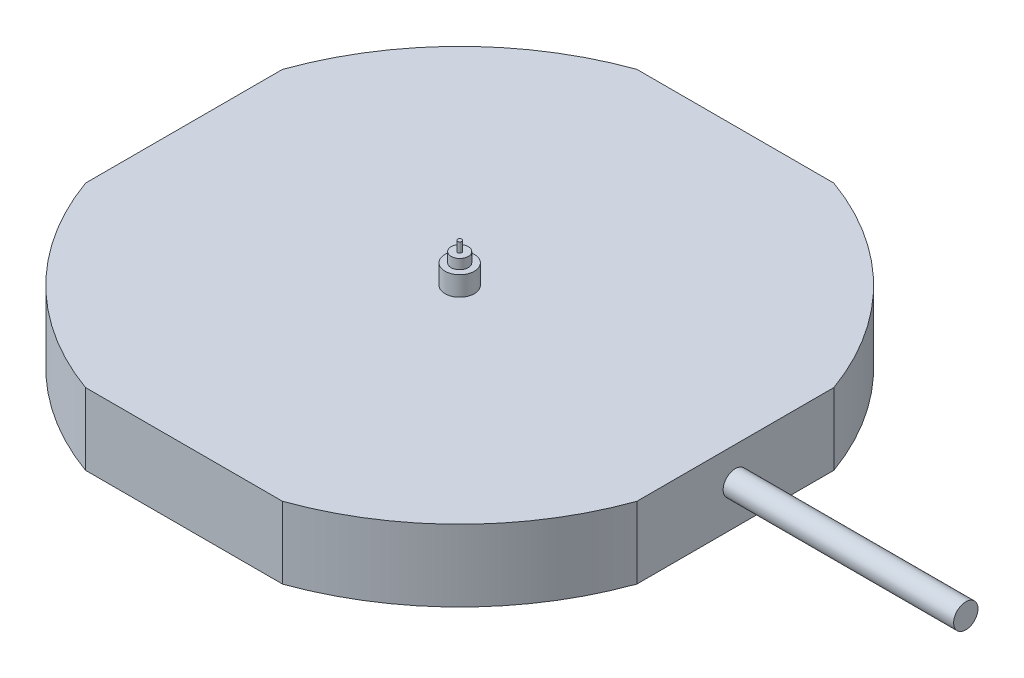
ISO-10303-21;
HEADER;
FILE_DESCRIPTION(('STEP AP214'),'2;1');
FILE_NAME('part.step','',(''),(''),'','','');
FILE_SCHEMA(('AUTOMOTIVE_DESIGN { 1 0 10303 214 1 1 1 1 }'));
ENDSEC;
DATA;
#1=APPLICATION_CONTEXT('core data for automotive mechanical design processes');
#2=APPLICATION_PROTOCOL_DEFINITION('international standard','automotive_design',2000,#1);
#3=PRODUCT_CONTEXT('',#1,'mechanical');
#4=PRODUCT('Part','Part','',(#3));
#5=PRODUCT_RELATED_PRODUCT_CATEGORY('part','',(#4));
#6=PRODUCT_DEFINITION_FORMATION('','',#4);
#7=PRODUCT_DEFINITION_CONTEXT('part definition',#1,'design');
#8=PRODUCT_DEFINITION('design','',#6,#7);
#9=PRODUCT_DEFINITION_SHAPE('','',#8);
#10=(LENGTH_UNIT() NAMED_UNIT(*) SI_UNIT(.MILLI.,.METRE.));
#11=(NAMED_UNIT(*) PLANE_ANGLE_UNIT() SI_UNIT($,.RADIAN.));
#12=(NAMED_UNIT(*) SI_UNIT($,.STERADIAN.) SOLID_ANGLE_UNIT());
#13=UNCERTAINTY_MEASURE_WITH_UNIT(LENGTH_MEASURE(1.E-05),#10,'distance_accuracy_value','');
#14=(GEOMETRIC_REPRESENTATION_CONTEXT(3) GLOBAL_UNCERTAINTY_ASSIGNED_CONTEXT((#13)) GLOBAL_UNIT_ASSIGNED_CONTEXT((#10,
#11,#12)) REPRESENTATION_CONTEXT('',''));
#15=CARTESIAN_POINT('',(0.,0.,0.));
#16=DIRECTION('',(0.,0.,1.));
#17=DIRECTION('',(1.,0.,0.));
#18=AXIS2_PLACEMENT_3D('',#15,#16,#17);
#19=CARTESIAN_POINT('',(0.,2.94,0.));
#20=DIRECTION('',(0.,-1.,0.));
#21=DIRECTION('',(0.,0.,-1.));
#22=AXIS2_PLACEMENT_3D('',#19,#20,#21);
#23=CYLINDRICAL_SURFACE('',#22,12.);
#24=DIRECTION('',(0.,-1.,0.));
#25=VECTOR('',#24,1.);
#26=CARTESIAN_POINT('',(4.03856410126174,2.94,-11.3));
#27=LINE('',#26,#25);
#28=CARTESIAN_POINT('',(4.03856410126174,2.94,-11.3));
#29=VERTEX_POINT('',#28);
#30=CARTESIAN_POINT('',(4.03856410126174,0.,-11.3));
#31=VERTEX_POINT('',#30);
#32=EDGE_CURVE('E57',#29,#31,#27,.T.);
#33=ORIENTED_EDGE('',*,*,#32,.F.);
#34=CARTESIAN_POINT('',(0.,2.94,0.));
#35=DIRECTION('',(0.,1.,0.));
#36=DIRECTION('',(0.,0.,1.));
#37=AXIS2_PLACEMENT_3D('',#34,#35,#36);
#38=CIRCLE('',#37,12.);
#39=CARTESIAN_POINT('',(11.3,2.94,-4.03856410126174));
#40=VERTEX_POINT('',#39);
#41=EDGE_CURVE('E141',#40,#29,#38,.T.);
#42=ORIENTED_EDGE('',*,*,#41,.F.);
#43=DIRECTION('',(0.,-1.,0.));
#44=VECTOR('',#43,1.);
#45=CARTESIAN_POINT('',(11.3,2.94,-4.03856410126174));
#46=LINE('',#45,#44);
#47=CARTESIAN_POINT('',(11.3,0.,-4.03856410126174));
#48=VERTEX_POINT('',#47);
#49=EDGE_CURVE('E187',#48,#40,#46,.F.);
#50=ORIENTED_EDGE('',*,*,#49,.F.);
#51=CARTESIAN_POINT('',(0.,0.,0.));
#52=DIRECTION('',(0.,1.,0.));
#53=DIRECTION('',(0.,0.,1.));
#54=AXIS2_PLACEMENT_3D('',#51,#52,#53);
#55=CIRCLE('',#54,12.);
#56=EDGE_CURVE('E118',#48,#31,#55,.T.);
#57=ORIENTED_EDGE('',*,*,#56,.T.);
#58=EDGE_LOOP('',(#33,#42,#50,#57));
#59=FACE_BOUND('',#58,.T.);
#60=ADVANCED_FACE('F33',(#59),#23,.T.);
#61=DIRECTION('',(0.,-1.,0.));
#62=VECTOR('',#61,1.);
#63=CARTESIAN_POINT('',(-4.03856410126174,2.94,-11.3));
#64=LINE('',#63,#62);
#65=CARTESIAN_POINT('',(-4.03856410126174,0.,-11.3));
#66=VERTEX_POINT('',#65);
#67=CARTESIAN_POINT('',(-4.03856410126174,2.94,-11.3));
#68=VERTEX_POINT('',#67);
#69=EDGE_CURVE('E99',#66,#68,#64,.F.);
#70=ORIENTED_EDGE('',*,*,#69,.F.);
#71=CARTESIAN_POINT('',(-11.3,0.,-4.03856410126174));
#72=VERTEX_POINT('',#71);
#73=EDGE_CURVE('E110',#66,#72,#55,.T.);
#74=ORIENTED_EDGE('',*,*,#73,.T.);
#75=DIRECTION('',(0.,-1.,0.));
#76=VECTOR('',#75,1.);
#77=CARTESIAN_POINT('',(-11.3,2.94,-4.03856410126174));
#78=LINE('',#77,#76);
#79=CARTESIAN_POINT('',(-11.3,2.94,-4.03856410126174));
#80=VERTEX_POINT('',#79);
#81=EDGE_CURVE('E126',#80,#72,#78,.T.);
#82=ORIENTED_EDGE('',*,*,#81,.F.);
#83=EDGE_CURVE('E112',#68,#80,#38,.T.);
#84=ORIENTED_EDGE('',*,*,#83,.F.);
#85=EDGE_LOOP('',(#70,#74,#82,#84));
#86=FACE_BOUND('',#85,.T.);
#87=ADVANCED_FACE('F108',(#86),#23,.T.);
#88=DIRECTION('',(0.,-1.,0.));
#89=VECTOR('',#88,1.);
#90=CARTESIAN_POINT('',(-4.03856410126174,2.94,11.3));
#91=LINE('',#90,#89);
#92=CARTESIAN_POINT('',(-4.03856410126174,2.94,11.3));
#93=VERTEX_POINT('',#92);
#94=CARTESIAN_POINT('',(-4.03856410126174,0.,11.3));
#95=VERTEX_POINT('',#94);
#96=EDGE_CURVE('E49',#93,#95,#91,.T.);
#97=ORIENTED_EDGE('',*,*,#96,.F.);
#98=CARTESIAN_POINT('',(-11.3,2.94,4.03856410126174));
#99=VERTEX_POINT('',#98);
#100=EDGE_CURVE('E139',#99,#93,#38,.T.);
#101=ORIENTED_EDGE('',*,*,#100,.F.);
#102=DIRECTION('',(0.,-1.,0.));
#103=VECTOR('',#102,1.);
#104=CARTESIAN_POINT('',(-11.3,2.94,4.03856410126174));
#105=LINE('',#104,#103);
#106=CARTESIAN_POINT('',(-11.3,0.,4.03856410126174));
#107=VERTEX_POINT('',#106);
#108=EDGE_CURVE('E132',#107,#99,#105,.F.);
#109=ORIENTED_EDGE('',*,*,#108,.F.);
#110=EDGE_CURVE('E119',#107,#95,#55,.T.);
#111=ORIENTED_EDGE('',*,*,#110,.T.);
#112=EDGE_LOOP('',(#97,#101,#109,#111));
#113=FACE_BOUND('',#112,.T.);
#114=ADVANCED_FACE('F157',(#113),#23,.T.);
#115=DIRECTION('',(0.,-1.,0.));
#116=VECTOR('',#115,1.);
#117=CARTESIAN_POINT('',(4.03856410126174,2.94,11.3));
#118=LINE('',#117,#116);
#119=CARTESIAN_POINT('',(4.03856410126174,0.,11.3));
#120=VERTEX_POINT('',#119);
#121=CARTESIAN_POINT('',(4.03856410126174,2.94,11.3));
#122=VERTEX_POINT('',#121);
#123=EDGE_CURVE('E181',#120,#122,#118,.F.);
#124=ORIENTED_EDGE('',*,*,#123,.F.);
#125=CARTESIAN_POINT('',(11.3,0.,4.03856410126174));
#126=VERTEX_POINT('',#125);
#127=EDGE_CURVE('E121',#120,#126,#55,.T.);
#128=ORIENTED_EDGE('',*,*,#127,.T.);
#129=DIRECTION('',(0.,-1.,0.));
#130=VECTOR('',#129,1.);
#131=CARTESIAN_POINT('',(11.3,2.94,4.03856410126174));
#132=LINE('',#131,#130);
#133=CARTESIAN_POINT('',(11.3,2.94,4.03856410126174));
#134=VERTEX_POINT('',#133);
#135=EDGE_CURVE('E136',#134,#126,#132,.T.);
#136=ORIENTED_EDGE('',*,*,#135,.F.);
#137=EDGE_CURVE('E122',#122,#134,#38,.T.);
#138=ORIENTED_EDGE('',*,*,#137,.F.);
#139=EDGE_LOOP('',(#124,#128,#136,#138));
#140=FACE_BOUND('',#139,.T.);
#141=ADVANCED_FACE('F194',(#140),#23,.T.);
#142=CARTESIAN_POINT('',(0.,2.94,0.));
#143=DIRECTION('',(0.,1.,0.));
#144=DIRECTION('',(0.,0.,1.));
#145=AXIS2_PLACEMENT_3D('',#142,#143,#144);
#146=PLANE('',#145);
#147=CARTESIAN_POINT('',(0.,2.94,0.));
#148=DIRECTION('',(0.,1.,0.));
#149=DIRECTION('',(0.,0.,1.));
#150=AXIS2_PLACEMENT_3D('',#147,#148,#149);
#151=CIRCLE('',#150,0.6);
#152=CARTESIAN_POINT('',(0.,2.94,0.6));
#153=VERTEX_POINT('',#152);
#154=EDGE_CURVE('E169',#153,#153,#151,.T.);
#155=ORIENTED_EDGE('',*,*,#154,.F.);
#156=EDGE_LOOP('',(#155));
#157=FACE_BOUND('',#156,.T.);
#158=ORIENTED_EDGE('',*,*,#100,.T.);
#159=DIRECTION('',(-1.,0.,0.));
#160=VECTOR('',#159,1.);
#161=CARTESIAN_POINT('',(0.,2.94,11.3));
#162=LINE('',#161,#160);
#163=EDGE_CURVE('E113',#122,#93,#162,.T.);
#164=ORIENTED_EDGE('',*,*,#163,.F.);
#165=ORIENTED_EDGE('',*,*,#137,.T.);
#166=DIRECTION('',(0.,0.,1.));
#167=VECTOR('',#166,1.);
#168=CARTESIAN_POINT('',(11.3,2.94,0.));
#169=LINE('',#168,#167);
#170=EDGE_CURVE('E184',#40,#134,#169,.T.);
#171=ORIENTED_EDGE('',*,*,#170,.F.);
#172=ORIENTED_EDGE('',*,*,#41,.T.);
#173=DIRECTION('',(1.,0.,0.));
#174=VECTOR('',#173,1.);
#175=CARTESIAN_POINT('',(0.,2.94,-11.3));
#176=LINE('',#175,#174);
#177=EDGE_CURVE('E175',#68,#29,#176,.T.);
#178=ORIENTED_EDGE('',*,*,#177,.F.);
#179=ORIENTED_EDGE('',*,*,#83,.T.);
#180=DIRECTION('',(0.,0.,-1.));
#181=VECTOR('',#180,1.);
#182=CARTESIAN_POINT('',(-11.3,2.94,0.));
#183=LINE('',#182,#181);
#184=EDGE_CURVE('E185',#99,#80,#183,.T.);
#185=ORIENTED_EDGE('',*,*,#184,.F.);
#186=EDGE_LOOP('',(#158,#164,#165,#171,#172,#178,#179,#185));
#187=FACE_BOUND('',#186,.T.);
#188=ADVANCED_FACE('F193',(#157,#187),#146,.T.);
#189=CARTESIAN_POINT('',(0.,0.,0.));
#190=DIRECTION('',(0.,1.,0.));
#191=DIRECTION('',(0.,0.,1.));
#192=AXIS2_PLACEMENT_3D('',#189,#190,#191);
#193=PLANE('',#192);
#194=DIRECTION('',(1.,0.,0.));
#195=VECTOR('',#194,1.);
#196=CARTESIAN_POINT('',(0.,0.,11.3));
#197=LINE('',#196,#195);
#198=EDGE_CURVE('E36',#95,#120,#197,.T.);
#199=ORIENTED_EDGE('',*,*,#198,.F.);
#200=ORIENTED_EDGE('',*,*,#110,.F.);
#201=DIRECTION('',(0.,0.,1.));
#202=VECTOR('',#201,1.);
#203=CARTESIAN_POINT('',(-11.3,0.,0.));
#204=LINE('',#203,#202);
#205=EDGE_CURVE('E105',#72,#107,#204,.T.);
#206=ORIENTED_EDGE('',*,*,#205,.F.);
#207=ORIENTED_EDGE('',*,*,#73,.F.);
#208=DIRECTION('',(-1.,0.,0.));
#209=VECTOR('',#208,1.);
#210=CARTESIAN_POINT('',(0.,0.,-11.3));
#211=LINE('',#210,#209);
#212=EDGE_CURVE('E96',#31,#66,#211,.T.);
#213=ORIENTED_EDGE('',*,*,#212,.F.);
#214=ORIENTED_EDGE('',*,*,#56,.F.);
#215=DIRECTION('',(0.,0.,-1.));
#216=VECTOR('',#215,1.);
#217=CARTESIAN_POINT('',(11.3,0.,0.));
#218=LINE('',#217,#216);
#219=EDGE_CURVE('E147',#126,#48,#218,.T.);
#220=ORIENTED_EDGE('',*,*,#219,.F.);
#221=ORIENTED_EDGE('',*,*,#127,.F.);
#222=EDGE_LOOP('',(#199,#200,#206,#207,#213,#214,#220,#221));
#223=FACE_BOUND('',#222,.T.);
#224=ADVANCED_FACE('F116',(#223),#193,.F.);
#225=CARTESIAN_POINT('',(11.3,2.94,0.));
#226=DIRECTION('',(1.,0.,0.));
#227=DIRECTION('',(0.,0.,-1.));
#228=AXIS2_PLACEMENT_3D('',#225,#226,#227);
#229=PLANE('',#228);
#230=CARTESIAN_POINT('',(11.3,1.58,0.));
#231=DIRECTION('',(1.,0.,0.));
#232=DIRECTION('',(0.,0.,-1.));
#233=AXIS2_PLACEMENT_3D('',#230,#231,#232);
#234=CIRCLE('',#233,0.5);
#235=CARTESIAN_POINT('',(11.3,1.58,-0.5));
#236=VERTEX_POINT('',#235);
#237=EDGE_CURVE('E168',#236,#236,#234,.T.);
#238=ORIENTED_EDGE('',*,*,#237,.F.);
#239=EDGE_LOOP('',(#238));
#240=FACE_BOUND('',#239,.T.);
#241=ORIENTED_EDGE('',*,*,#135,.T.);
#242=ORIENTED_EDGE('',*,*,#219,.T.);
#243=ORIENTED_EDGE('',*,*,#49,.T.);
#244=ORIENTED_EDGE('',*,*,#170,.T.);
#245=EDGE_LOOP('',(#241,#242,#243,#244));
#246=FACE_BOUND('',#245,.T.);
#247=ADVANCED_FACE('F190',(#240,#246),#229,.T.);
#248=CARTESIAN_POINT('',(-11.3,2.94,0.));
#249=DIRECTION('',(-1.,0.,0.));
#250=DIRECTION('',(0.,0.,1.));
#251=AXIS2_PLACEMENT_3D('',#248,#249,#250);
#252=PLANE('',#251);
#253=ORIENTED_EDGE('',*,*,#81,.T.);
#254=ORIENTED_EDGE('',*,*,#205,.T.);
#255=ORIENTED_EDGE('',*,*,#108,.T.);
#256=ORIENTED_EDGE('',*,*,#184,.T.);
#257=EDGE_LOOP('',(#253,#254,#255,#256));
#258=FACE_BOUND('',#257,.T.);
#259=ADVANCED_FACE('F155',(#258),#252,.T.);
#260=CARTESIAN_POINT('',(0.,2.94,-11.3));
#261=DIRECTION('',(0.,0.,-1.));
#262=DIRECTION('',(-1.,0.,0.));
#263=AXIS2_PLACEMENT_3D('',#260,#261,#262);
#264=PLANE('',#263);
#265=ORIENTED_EDGE('',*,*,#32,.T.);
#266=ORIENTED_EDGE('',*,*,#212,.T.);
#267=ORIENTED_EDGE('',*,*,#69,.T.);
#268=ORIENTED_EDGE('',*,*,#177,.T.);
#269=EDGE_LOOP('',(#265,#266,#267,#268));
#270=FACE_BOUND('',#269,.T.);
#271=ADVANCED_FACE('F98',(#270),#264,.T.);
#272=CARTESIAN_POINT('',(0.,2.94,11.3));
#273=DIRECTION('',(0.,0.,1.));
#274=DIRECTION('',(1.,0.,0.));
#275=AXIS2_PLACEMENT_3D('',#272,#273,#274);
#276=PLANE('',#275);
#277=ORIENTED_EDGE('',*,*,#96,.T.);
#278=ORIENTED_EDGE('',*,*,#198,.T.);
#279=ORIENTED_EDGE('',*,*,#123,.T.);
#280=ORIENTED_EDGE('',*,*,#163,.T.);
#281=EDGE_LOOP('',(#277,#278,#279,#280));
#282=FACE_BOUND('',#281,.T.);
#283=ADVANCED_FACE('F195',(#282),#276,.T.);
#284=CARTESIAN_POINT('',(20.75,1.58,0.));
#285=DIRECTION('',(-1.,0.,0.));
#286=DIRECTION('',(0.,0.,1.));
#287=AXIS2_PLACEMENT_3D('',#284,#285,#286);
#288=CYLINDRICAL_SURFACE('',#287,0.5);
#289=CARTESIAN_POINT('',(20.75,1.58,0.));
#290=DIRECTION('',(1.,0.,0.));
#291=DIRECTION('',(0.,0.,-1.));
#292=AXIS2_PLACEMENT_3D('',#289,#290,#291);
#293=CIRCLE('',#292,0.5);
#294=CARTESIAN_POINT('',(20.75,1.58,-0.5));
#295=VERTEX_POINT('',#294);
#296=EDGE_CURVE('E172',#295,#295,#293,.T.);
#297=ORIENTED_EDGE('',*,*,#296,.F.);
#298=EDGE_LOOP('',(#297));
#299=FACE_BOUND('',#298,.T.);
#300=ORIENTED_EDGE('',*,*,#237,.T.);
#301=EDGE_LOOP('',(#300));
#302=FACE_BOUND('',#301,.T.);
#303=ADVANCED_FACE('F197',(#299,#302),#288,.T.);
#304=CARTESIAN_POINT('',(20.75,1.58,0.));
#305=DIRECTION('',(1.,0.,0.));
#306=DIRECTION('',(0.,0.,-1.));
#307=AXIS2_PLACEMENT_3D('',#304,#305,#306);
#308=PLANE('',#307);
#309=ORIENTED_EDGE('',*,*,#296,.T.);
#310=EDGE_LOOP('',(#309));
#311=FACE_BOUND('',#310,.T.);
#312=ADVANCED_FACE('F203',(#311),#308,.T.);
#313=CARTESIAN_POINT('',(0.,3.74,0.));
#314=DIRECTION('',(0.,-1.,0.));
#315=DIRECTION('',(0.,0.,-1.));
#316=AXIS2_PLACEMENT_3D('',#313,#314,#315);
#317=CYLINDRICAL_SURFACE('',#316,0.6);
#318=CARTESIAN_POINT('',(0.,3.74,0.));
#319=DIRECTION('',(0.,1.,0.));
#320=DIRECTION('',(0.,0.,1.));
#321=AXIS2_PLACEMENT_3D('',#318,#319,#320);
#322=CIRCLE('',#321,0.6);
#323=CARTESIAN_POINT('',(0.,3.74,0.6));
#324=VERTEX_POINT('',#323);
#325=EDGE_CURVE('E165',#324,#324,#322,.T.);
#326=ORIENTED_EDGE('',*,*,#325,.F.);
#327=EDGE_LOOP('',(#326));
#328=FACE_BOUND('',#327,.T.);
#329=ORIENTED_EDGE('',*,*,#154,.T.);
#330=EDGE_LOOP('',(#329));
#331=FACE_BOUND('',#330,.T.);
#332=ADVANCED_FACE('F278',(#328,#331),#317,.T.);
#333=CARTESIAN_POINT('',(0.,3.74,0.));
#334=DIRECTION('',(0.,1.,0.));
#335=DIRECTION('',(0.,0.,1.));
#336=AXIS2_PLACEMENT_3D('',#333,#334,#335);
#337=PLANE('',#336);
#338=CARTESIAN_POINT('',(0.,3.74,0.));
#339=DIRECTION('',(0.,1.,0.));
#340=DIRECTION('',(0.,0.,1.));
#341=AXIS2_PLACEMENT_3D('',#338,#339,#340);
#342=CIRCLE('',#341,0.35);
#343=CARTESIAN_POINT('',(0.,3.74,0.35));
#344=VERTEX_POINT('',#343);
#345=EDGE_CURVE('E41',#344,#344,#342,.T.);
#346=ORIENTED_EDGE('',*,*,#345,.F.);
#347=EDGE_LOOP('',(#346));
#348=FACE_BOUND('',#347,.T.);
#349=ORIENTED_EDGE('',*,*,#325,.T.);
#350=EDGE_LOOP('',(#349));
#351=FACE_BOUND('',#350,.T.);
#352=ADVANCED_FACE('F295',(#348,#351),#337,.T.);
#353=CARTESIAN_POINT('',(0.,4.14,0.));
#354=DIRECTION('',(0.,-1.,0.));
#355=DIRECTION('',(0.,0.,-1.));
#356=AXIS2_PLACEMENT_3D('',#353,#354,#355);
#357=CYLINDRICAL_SURFACE('',#356,0.35);
#358=CARTESIAN_POINT('',(0.,4.14,0.));
#359=DIRECTION('',(0.,1.,0.));
#360=DIRECTION('',(0.,0.,1.));
#361=AXIS2_PLACEMENT_3D('',#358,#359,#360);
#362=CIRCLE('',#361,0.35);
#363=CARTESIAN_POINT('',(0.,4.14,0.35));
#364=VERTEX_POINT('',#363);
#365=EDGE_CURVE('E164',#364,#364,#362,.T.);
#366=ORIENTED_EDGE('',*,*,#365,.F.);
#367=EDGE_LOOP('',(#366));
#368=FACE_BOUND('',#367,.T.);
#369=ORIENTED_EDGE('',*,*,#345,.T.);
#370=EDGE_LOOP('',(#369));
#371=FACE_BOUND('',#370,.T.);
#372=ADVANCED_FACE('F305',(#368,#371),#357,.T.);
#373=CARTESIAN_POINT('',(0.,4.14,0.));
#374=DIRECTION('',(0.,1.,0.));
#375=DIRECTION('',(0.,0.,1.));
#376=AXIS2_PLACEMENT_3D('',#373,#374,#375);
#377=PLANE('',#376);
#378=CARTESIAN_POINT('',(0.,4.14,0.));
#379=DIRECTION('',(0.,1.,0.));
#380=DIRECTION('',(0.,0.,1.));
#381=AXIS2_PLACEMENT_3D('',#378,#379,#380);
#382=CIRCLE('',#381,0.085);
#383=CARTESIAN_POINT('',(0.,4.14,0.085));
#384=VERTEX_POINT('',#383);
#385=EDGE_CURVE('E11',#384,#384,#382,.T.);
#386=ORIENTED_EDGE('',*,*,#385,.F.);
#387=EDGE_LOOP('',(#386));
#388=FACE_BOUND('',#387,.T.);
#389=ORIENTED_EDGE('',*,*,#365,.T.);
#390=EDGE_LOOP('',(#389));
#391=FACE_BOUND('',#390,.T.);
#392=ADVANCED_FACE('F315',(#388,#391),#377,.T.);
#393=CARTESIAN_POINT('',(0.,4.54,0.));
#394=DIRECTION('',(0.,-1.,0.));
#395=DIRECTION('',(0.,0.,-1.));
#396=AXIS2_PLACEMENT_3D('',#393,#394,#395);
#397=CYLINDRICAL_SURFACE('',#396,0.085);
#398=CARTESIAN_POINT('',(0.,4.54,0.));
#399=DIRECTION('',(0.,1.,0.));
#400=DIRECTION('',(0.,0.,1.));
#401=AXIS2_PLACEMENT_3D('',#398,#399,#400);
#402=CIRCLE('',#401,0.085);
#403=CARTESIAN_POINT('',(0.,4.54,0.085));
#404=VERTEX_POINT('',#403);
#405=EDGE_CURVE('E351',#404,#404,#402,.T.);
#406=ORIENTED_EDGE('',*,*,#405,.F.);
#407=EDGE_LOOP('',(#406));
#408=FACE_BOUND('',#407,.T.);
#409=ORIENTED_EDGE('',*,*,#385,.T.);
#410=EDGE_LOOP('',(#409));
#411=FACE_BOUND('',#410,.T.);
#412=ADVANCED_FACE('F325',(#408,#411),#397,.T.);
#413=CARTESIAN_POINT('',(0.,4.54,0.));
#414=DIRECTION('',(0.,1.,0.));
#415=DIRECTION('',(0.,0.,1.));
#416=AXIS2_PLACEMENT_3D('',#413,#414,#415);
#417=PLANE('',#416);
#418=ORIENTED_EDGE('',*,*,#405,.T.);
#419=EDGE_LOOP('',(#418));
#420=FACE_BOUND('',#419,.T.);
#421=ADVANCED_FACE('F335',(#420),#417,.T.);
#422=CLOSED_SHELL('',(#60,#87,#114,#141,#188,#224,#247,#259,#271,#283,#303,#312,#332,#352,#372,
#392,#412,#421));
#423=MANIFOLD_SOLID_BREP('B2',#422);
#424=ADVANCED_BREP_SHAPE_REPRESENTATION('',(#18,#423),#14);
#425=SHAPE_DEFINITION_REPRESENTATION(#9,#424);
ENDSEC;
END-ISO-10303-21;
